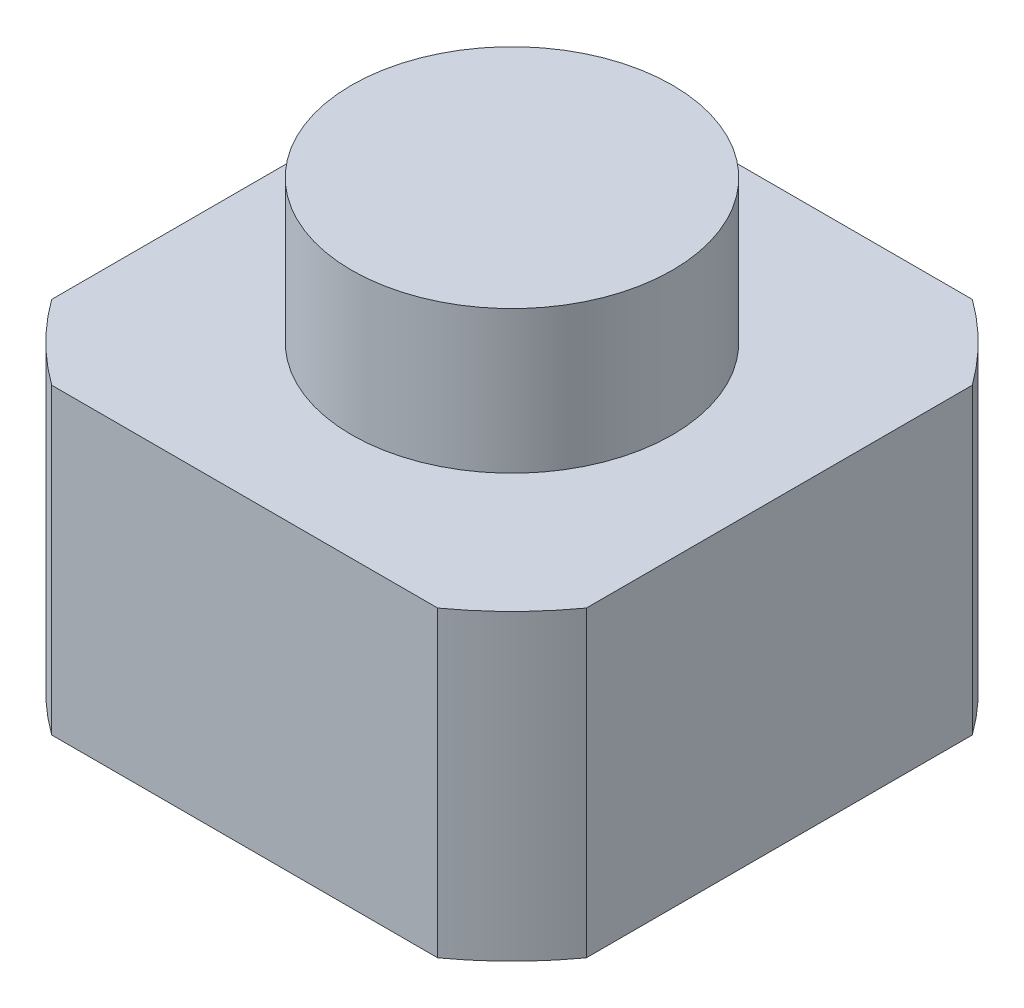
ISO-10303-21;
HEADER;
FILE_DESCRIPTION(('STEP AP214'),'2;1');
FILE_NAME('part.step','',(''),(''),'','','');
FILE_SCHEMA(('AUTOMOTIVE_DESIGN { 1 0 10303 214 1 1 1 1 }'));
ENDSEC;
DATA;
#1=APPLICATION_CONTEXT('core data for automotive mechanical design processes');
#2=APPLICATION_PROTOCOL_DEFINITION('international standard','automotive_design',2000,#1);
#3=PRODUCT_CONTEXT('',#1,'mechanical');
#4=PRODUCT('Part','Part','',(#3));
#5=PRODUCT_RELATED_PRODUCT_CATEGORY('part','',(#4));
#6=PRODUCT_DEFINITION_FORMATION('','',#4);
#7=PRODUCT_DEFINITION_CONTEXT('part definition',#1,'design');
#8=PRODUCT_DEFINITION('design','',#6,#7);
#9=PRODUCT_DEFINITION_SHAPE('','',#8);
#10=(LENGTH_UNIT() NAMED_UNIT(*) SI_UNIT(.MILLI.,.METRE.));
#11=(NAMED_UNIT(*) PLANE_ANGLE_UNIT() SI_UNIT($,.RADIAN.));
#12=(NAMED_UNIT(*) SI_UNIT($,.STERADIAN.) SOLID_ANGLE_UNIT());
#13=UNCERTAINTY_MEASURE_WITH_UNIT(LENGTH_MEASURE(1.E-05),#10,'distance_accuracy_value','');
#14=(GEOMETRIC_REPRESENTATION_CONTEXT(3) GLOBAL_UNCERTAINTY_ASSIGNED_CONTEXT((#13)) GLOBAL_UNIT_ASSIGNED_CONTEXT((#10,
#11,#12)) REPRESENTATION_CONTEXT('',''));
#15=CARTESIAN_POINT('',(0.,0.,0.));
#16=DIRECTION('',(0.,0.,1.));
#17=DIRECTION('',(1.,0.,0.));
#18=AXIS2_PLACEMENT_3D('',#15,#16,#17);
#19=CARTESIAN_POINT('',(0.,3.4,0.));
#20=DIRECTION('',(0.,1.,0.));
#21=DIRECTION('',(0.,0.,1.));
#22=AXIS2_PLACEMENT_3D('',#19,#20,#21);
#23=PLANE('',#22);
#24=CARTESIAN_POINT('',(0.,3.4,0.));
#25=DIRECTION('',(0.,1.,0.));
#26=DIRECTION('',(0.,0.,1.));
#27=AXIS2_PLACEMENT_3D('',#24,#25,#26);
#28=CIRCLE('',#27,3.7);
#29=CARTESIAN_POINT('',(-2.16564078277077,3.4,-3.));
#30=VERTEX_POINT('',#29);
#31=CARTESIAN_POINT('',(-3.,3.4,-2.16564078277077));
#32=VERTEX_POINT('',#31);
#33=EDGE_CURVE('E145',#30,#32,#28,.T.);
#34=ORIENTED_EDGE('',*,*,#33,.T.);
#35=DIRECTION('',(0.,0.,1.));
#36=VECTOR('',#35,1.);
#37=CARTESIAN_POINT('',(-3.,3.4,2.16564078277077));
#38=LINE('',#37,#36);
#39=CARTESIAN_POINT('',(-3.,3.4,2.16564078277077));
#40=VERTEX_POINT('',#39);
#41=EDGE_CURVE('E93',#32,#40,#38,.T.);
#42=ORIENTED_EDGE('',*,*,#41,.T.);
#43=CARTESIAN_POINT('',(0.,3.4,0.));
#44=DIRECTION('',(0.,1.,0.));
#45=DIRECTION('',(0.,0.,1.));
#46=AXIS2_PLACEMENT_3D('',#43,#44,#45);
#47=CIRCLE('',#46,3.7);
#48=CARTESIAN_POINT('',(-2.16564078277077,3.4,3.));
#49=VERTEX_POINT('',#48);
#50=EDGE_CURVE('E160',#40,#49,#47,.T.);
#51=ORIENTED_EDGE('',*,*,#50,.T.);
#52=DIRECTION('',(1.,0.,0.));
#53=VECTOR('',#52,1.);
#54=CARTESIAN_POINT('',(-2.16564078277077,3.4,3.));
#55=LINE('',#54,#53);
#56=CARTESIAN_POINT('',(2.16564078277077,3.4,3.));
#57=VERTEX_POINT('',#56);
#58=EDGE_CURVE('E172',#49,#57,#55,.T.);
#59=ORIENTED_EDGE('',*,*,#58,.T.);
#60=CARTESIAN_POINT('',(0.,3.4,0.));
#61=DIRECTION('',(0.,1.,0.));
#62=DIRECTION('',(0.,0.,1.));
#63=AXIS2_PLACEMENT_3D('',#60,#61,#62);
#64=CIRCLE('',#63,3.7);
#65=CARTESIAN_POINT('',(3.,3.4,2.16564078277077));
#66=VERTEX_POINT('',#65);
#67=EDGE_CURVE('E112',#57,#66,#64,.T.);
#68=ORIENTED_EDGE('',*,*,#67,.T.);
#69=DIRECTION('',(0.,0.,-1.));
#70=VECTOR('',#69,1.);
#71=CARTESIAN_POINT('',(3.,3.4,2.16564078277077));
#72=LINE('',#71,#70);
#73=CARTESIAN_POINT('',(3.,3.4,-2.16564078277077));
#74=VERTEX_POINT('',#73);
#75=EDGE_CURVE('E106',#66,#74,#72,.T.);
#76=ORIENTED_EDGE('',*,*,#75,.T.);
#77=CARTESIAN_POINT('',(0.,3.4,0.));
#78=DIRECTION('',(0.,1.,0.));
#79=DIRECTION('',(0.,0.,1.));
#80=AXIS2_PLACEMENT_3D('',#77,#78,#79);
#81=CIRCLE('',#80,3.7);
#82=CARTESIAN_POINT('',(2.16564078277077,3.4,-3.));
#83=VERTEX_POINT('',#82);
#84=EDGE_CURVE('E110',#74,#83,#81,.T.);
#85=ORIENTED_EDGE('',*,*,#84,.T.);
#86=DIRECTION('',(-1.,0.,0.));
#87=VECTOR('',#86,1.);
#88=CARTESIAN_POINT('',(-2.16564078277077,3.4,-3.));
#89=LINE('',#88,#87);
#90=EDGE_CURVE('E50',#83,#30,#89,.T.);
#91=ORIENTED_EDGE('',*,*,#90,.T.);
#92=EDGE_LOOP('',(#34,#42,#51,#59,#68,#76,#85,#91));
#93=FACE_BOUND('',#92,.T.);
#94=CARTESIAN_POINT('',(0.,3.4,0.));
#95=DIRECTION('',(0.,1.,0.));
#96=DIRECTION('',(0.,0.,1.));
#97=AXIS2_PLACEMENT_3D('',#94,#95,#96);
#98=CIRCLE('',#97,1.8);
#99=CARTESIAN_POINT('',(0.,3.4,1.8));
#100=VERTEX_POINT('',#99);
#101=EDGE_CURVE('E180',#100,#100,#98,.T.);
#102=ORIENTED_EDGE('',*,*,#101,.F.);
#103=EDGE_LOOP('',(#102));
#104=FACE_BOUND('',#103,.T.);
#105=ADVANCED_FACE('F33',(#93,#104),#23,.T.);
#106=CARTESIAN_POINT('',(0.,3.4,0.));
#107=DIRECTION('',(0.,-1.,0.));
#108=DIRECTION('',(0.,0.,-1.));
#109=AXIS2_PLACEMENT_3D('',#106,#107,#108);
#110=CYLINDRICAL_SURFACE('',#109,3.7);
#111=CARTESIAN_POINT('',(0.,0.,0.));
#112=DIRECTION('',(0.,1.,0.));
#113=DIRECTION('',(0.,0.,1.));
#114=AXIS2_PLACEMENT_3D('',#111,#112,#113);
#115=CIRCLE('',#114,3.7);
#116=CARTESIAN_POINT('',(-2.16564078277077,0.,-3.));
#117=VERTEX_POINT('',#116);
#118=CARTESIAN_POINT('',(-3.,0.,-2.16564078277077));
#119=VERTEX_POINT('',#118);
#120=EDGE_CURVE('E130',#117,#119,#115,.T.);
#121=ORIENTED_EDGE('',*,*,#120,.T.);
#122=DIRECTION('',(0.,-1.,0.));
#123=VECTOR('',#122,1.);
#124=CARTESIAN_POINT('',(-3.,3.4,-2.16564078277077));
#125=LINE('',#124,#123);
#126=EDGE_CURVE('E12',#32,#119,#125,.T.);
#127=ORIENTED_EDGE('',*,*,#126,.F.);
#128=ORIENTED_EDGE('',*,*,#33,.F.);
#129=DIRECTION('',(0.,-1.,0.));
#130=VECTOR('',#129,1.);
#131=CARTESIAN_POINT('',(-2.16564078277077,3.4,-3.));
#132=LINE('',#131,#130);
#133=EDGE_CURVE('E126',#30,#117,#132,.T.);
#134=ORIENTED_EDGE('',*,*,#133,.T.);
#135=EDGE_LOOP('',(#121,#127,#128,#134));
#136=FACE_BOUND('',#135,.T.);
#137=ADVANCED_FACE('F35',(#136),#110,.T.);
#138=CARTESIAN_POINT('',(-3.,3.4,2.16564078277077));
#139=DIRECTION('',(1.,0.,0.));
#140=DIRECTION('',(0.,0.,-1.));
#141=AXIS2_PLACEMENT_3D('',#138,#139,#140);
#142=PLANE('',#141);
#143=DIRECTION('',(0.,0.,1.));
#144=VECTOR('',#143,1.);
#145=CARTESIAN_POINT('',(-3.,0.,2.16564078277077));
#146=LINE('',#145,#144);
#147=CARTESIAN_POINT('',(-3.,0.,2.16564078277077));
#148=VERTEX_POINT('',#147);
#149=EDGE_CURVE('E133',#119,#148,#146,.T.);
#150=ORIENTED_EDGE('',*,*,#149,.T.);
#151=DIRECTION('',(0.,-1.,0.));
#152=VECTOR('',#151,1.);
#153=CARTESIAN_POINT('',(-3.,3.4,2.16564078277077));
#154=LINE('',#153,#152);
#155=EDGE_CURVE('E42',#40,#148,#154,.T.);
#156=ORIENTED_EDGE('',*,*,#155,.F.);
#157=ORIENTED_EDGE('',*,*,#41,.F.);
#158=ORIENTED_EDGE('',*,*,#126,.T.);
#159=EDGE_LOOP('',(#150,#156,#157,#158));
#160=FACE_BOUND('',#159,.T.);
#161=ADVANCED_FACE('F191',(#160),#142,.F.);
#162=CARTESIAN_POINT('',(0.,3.4,0.));
#163=DIRECTION('',(0.,-1.,0.));
#164=DIRECTION('',(0.,0.,-1.));
#165=AXIS2_PLACEMENT_3D('',#162,#163,#164);
#166=CYLINDRICAL_SURFACE('',#165,3.7);
#167=CARTESIAN_POINT('',(0.,0.,0.));
#168=DIRECTION('',(0.,1.,0.));
#169=DIRECTION('',(0.,0.,1.));
#170=AXIS2_PLACEMENT_3D('',#167,#168,#169);
#171=CIRCLE('',#170,3.7);
#172=CARTESIAN_POINT('',(-2.16564078277077,0.,3.));
#173=VERTEX_POINT('',#172);
#174=EDGE_CURVE('E136',#148,#173,#171,.T.);
#175=ORIENTED_EDGE('',*,*,#174,.T.);
#176=DIRECTION('',(0.,-1.,0.));
#177=VECTOR('',#176,1.);
#178=CARTESIAN_POINT('',(-2.16564078277077,3.4,3.));
#179=LINE('',#178,#177);
#180=EDGE_CURVE('E152',#49,#173,#179,.T.);
#181=ORIENTED_EDGE('',*,*,#180,.F.);
#182=ORIENTED_EDGE('',*,*,#50,.F.);
#183=ORIENTED_EDGE('',*,*,#155,.T.);
#184=EDGE_LOOP('',(#175,#181,#182,#183));
#185=FACE_BOUND('',#184,.T.);
#186=ADVANCED_FACE('F158',(#185),#166,.T.);
#187=CARTESIAN_POINT('',(-2.16564078277077,3.4,3.));
#188=DIRECTION('',(0.,0.,-1.));
#189=DIRECTION('',(-1.,0.,0.));
#190=AXIS2_PLACEMENT_3D('',#187,#188,#189);
#191=PLANE('',#190);
#192=DIRECTION('',(1.,0.,0.));
#193=VECTOR('',#192,1.);
#194=CARTESIAN_POINT('',(-2.16564078277077,0.,3.));
#195=LINE('',#194,#193);
#196=CARTESIAN_POINT('',(2.16564078277077,0.,3.));
#197=VERTEX_POINT('',#196);
#198=EDGE_CURVE('E138',#173,#197,#195,.T.);
#199=ORIENTED_EDGE('',*,*,#198,.T.);
#200=DIRECTION('',(0.,-1.,0.));
#201=VECTOR('',#200,1.);
#202=CARTESIAN_POINT('',(2.16564078277077,3.4,3.));
#203=LINE('',#202,#201);
#204=EDGE_CURVE('E149',#57,#197,#203,.T.);
#205=ORIENTED_EDGE('',*,*,#204,.F.);
#206=ORIENTED_EDGE('',*,*,#58,.F.);
#207=ORIENTED_EDGE('',*,*,#180,.T.);
#208=EDGE_LOOP('',(#199,#205,#206,#207));
#209=FACE_BOUND('',#208,.T.);
#210=ADVANCED_FACE('F168',(#209),#191,.F.);
#211=CARTESIAN_POINT('',(0.,3.4,0.));
#212=DIRECTION('',(0.,-1.,0.));
#213=DIRECTION('',(0.,0.,-1.));
#214=AXIS2_PLACEMENT_3D('',#211,#212,#213);
#215=CYLINDRICAL_SURFACE('',#214,3.7);
#216=CARTESIAN_POINT('',(0.,0.,0.));
#217=DIRECTION('',(0.,1.,0.));
#218=DIRECTION('',(0.,0.,1.));
#219=AXIS2_PLACEMENT_3D('',#216,#217,#218);
#220=CIRCLE('',#219,3.7);
#221=CARTESIAN_POINT('',(3.,0.,2.16564078277077));
#222=VERTEX_POINT('',#221);
#223=EDGE_CURVE('E140',#197,#222,#220,.T.);
#224=ORIENTED_EDGE('',*,*,#223,.T.);
#225=DIRECTION('',(0.,-1.,0.));
#226=VECTOR('',#225,1.);
#227=CARTESIAN_POINT('',(3.,3.4,2.16564078277077));
#228=LINE('',#227,#226);
#229=EDGE_CURVE('E121',#66,#222,#228,.T.);
#230=ORIENTED_EDGE('',*,*,#229,.F.);
#231=ORIENTED_EDGE('',*,*,#67,.F.);
#232=ORIENTED_EDGE('',*,*,#204,.T.);
#233=EDGE_LOOP('',(#224,#230,#231,#232));
#234=FACE_BOUND('',#233,.T.);
#235=ADVANCED_FACE('F171',(#234),#215,.T.);
#236=CARTESIAN_POINT('',(3.,3.4,2.16564078277077));
#237=DIRECTION('',(-1.,0.,0.));
#238=DIRECTION('',(0.,0.,1.));
#239=AXIS2_PLACEMENT_3D('',#236,#237,#238);
#240=PLANE('',#239);
#241=DIRECTION('',(0.,0.,-1.));
#242=VECTOR('',#241,1.);
#243=CARTESIAN_POINT('',(3.,0.,2.16564078277077));
#244=LINE('',#243,#242);
#245=CARTESIAN_POINT('',(3.,0.,-2.16564078277077));
#246=VERTEX_POINT('',#245);
#247=EDGE_CURVE('E120',#222,#246,#244,.T.);
#248=ORIENTED_EDGE('',*,*,#247,.T.);
#249=DIRECTION('',(0.,-1.,0.));
#250=VECTOR('',#249,1.);
#251=CARTESIAN_POINT('',(3.,3.4,-2.16564078277077));
#252=LINE('',#251,#250);
#253=EDGE_CURVE('E117',#74,#246,#252,.T.);
#254=ORIENTED_EDGE('',*,*,#253,.F.);
#255=ORIENTED_EDGE('',*,*,#75,.F.);
#256=ORIENTED_EDGE('',*,*,#229,.T.);
#257=EDGE_LOOP('',(#248,#254,#255,#256));
#258=FACE_BOUND('',#257,.T.);
#259=ADVANCED_FACE('F118',(#258),#240,.F.);
#260=CARTESIAN_POINT('',(0.,3.4,0.));
#261=DIRECTION('',(0.,-1.,0.));
#262=DIRECTION('',(0.,0.,-1.));
#263=AXIS2_PLACEMENT_3D('',#260,#261,#262);
#264=CYLINDRICAL_SURFACE('',#263,3.7);
#265=CARTESIAN_POINT('',(0.,0.,0.));
#266=DIRECTION('',(0.,1.,0.));
#267=DIRECTION('',(0.,0.,1.));
#268=AXIS2_PLACEMENT_3D('',#265,#266,#267);
#269=CIRCLE('',#268,3.7);
#270=CARTESIAN_POINT('',(2.16564078277077,0.,-3.));
#271=VERTEX_POINT('',#270);
#272=EDGE_CURVE('E79',#246,#271,#269,.T.);
#273=ORIENTED_EDGE('',*,*,#272,.T.);
#274=DIRECTION('',(0.,-1.,0.));
#275=VECTOR('',#274,1.);
#276=CARTESIAN_POINT('',(2.16564078277077,3.4,-3.));
#277=LINE('',#276,#275);
#278=EDGE_CURVE('E122',#83,#271,#277,.T.);
#279=ORIENTED_EDGE('',*,*,#278,.F.);
#280=ORIENTED_EDGE('',*,*,#84,.F.);
#281=ORIENTED_EDGE('',*,*,#253,.T.);
#282=EDGE_LOOP('',(#273,#279,#280,#281));
#283=FACE_BOUND('',#282,.T.);
#284=ADVANCED_FACE('F124',(#283),#264,.T.);
#285=CARTESIAN_POINT('',(-2.16564078277077,3.4,-3.));
#286=DIRECTION('',(0.,0.,1.));
#287=DIRECTION('',(1.,0.,0.));
#288=AXIS2_PLACEMENT_3D('',#285,#286,#287);
#289=PLANE('',#288);
#290=DIRECTION('',(-1.,0.,0.));
#291=VECTOR('',#290,1.);
#292=CARTESIAN_POINT('',(-2.16564078277077,0.,-3.));
#293=LINE('',#292,#291);
#294=EDGE_CURVE('E85',#271,#117,#293,.T.);
#295=ORIENTED_EDGE('',*,*,#294,.T.);
#296=ORIENTED_EDGE('',*,*,#133,.F.);
#297=ORIENTED_EDGE('',*,*,#90,.F.);
#298=ORIENTED_EDGE('',*,*,#278,.T.);
#299=EDGE_LOOP('',(#295,#296,#297,#298));
#300=FACE_BOUND('',#299,.T.);
#301=ADVANCED_FACE('F199',(#300),#289,.F.);
#302=CARTESIAN_POINT('',(0.,0.,0.));
#303=DIRECTION('',(0.,1.,0.));
#304=DIRECTION('',(0.,0.,1.));
#305=AXIS2_PLACEMENT_3D('',#302,#303,#304);
#306=PLANE('',#305);
#307=ORIENTED_EDGE('',*,*,#120,.F.);
#308=ORIENTED_EDGE('',*,*,#294,.F.);
#309=ORIENTED_EDGE('',*,*,#272,.F.);
#310=ORIENTED_EDGE('',*,*,#247,.F.);
#311=ORIENTED_EDGE('',*,*,#223,.F.);
#312=ORIENTED_EDGE('',*,*,#198,.F.);
#313=ORIENTED_EDGE('',*,*,#174,.F.);
#314=ORIENTED_EDGE('',*,*,#149,.F.);
#315=EDGE_LOOP('',(#307,#308,#309,#310,#311,#312,#313,#314));
#316=FACE_BOUND('',#315,.T.);
#317=ADVANCED_FACE('F164',(#316),#306,.F.);
#318=CARTESIAN_POINT('',(0.,15.0911688245431,0.));
#319=DIRECTION('',(0.,-1.,0.));
#320=DIRECTION('',(0.,0.,-1.));
#321=AXIS2_PLACEMENT_3D('',#318,#319,#320);
#322=CYLINDRICAL_SURFACE('',#321,1.8);
#323=ORIENTED_EDGE('',*,*,#101,.T.);
#324=EDGE_LOOP('',(#323));
#325=FACE_BOUND('',#324,.T.);
#326=CARTESIAN_POINT('',(0.,5.,0.));
#327=DIRECTION('',(0.,1.,0.));
#328=DIRECTION('',(0.,0.,1.));
#329=AXIS2_PLACEMENT_3D('',#326,#327,#328);
#330=CIRCLE('',#329,1.8);
#331=CARTESIAN_POINT('',(0.,5.,1.8));
#332=VERTEX_POINT('',#331);
#333=EDGE_CURVE('E134',#332,#332,#330,.T.);
#334=ORIENTED_EDGE('',*,*,#333,.F.);
#335=EDGE_LOOP('',(#334));
#336=FACE_BOUND('',#335,.T.);
#337=ADVANCED_FACE('F184',(#325,#336),#322,.T.);
#338=CARTESIAN_POINT('',(0.,5.,0.));
#339=DIRECTION('',(0.,1.,0.));
#340=DIRECTION('',(0.,0.,1.));
#341=AXIS2_PLACEMENT_3D('',#338,#339,#340);
#342=PLANE('',#341);
#343=ORIENTED_EDGE('',*,*,#333,.T.);
#344=EDGE_LOOP('',(#343));
#345=FACE_BOUND('',#344,.T.);
#346=ADVANCED_FACE('F195',(#345),#342,.T.);
#347=CLOSED_SHELL('',(#105,#137,#161,#186,#210,#235,#259,#284,#301,#317,#337,#346));
#348=MANIFOLD_SOLID_BREP('B2',#347);
#349=ADVANCED_BREP_SHAPE_REPRESENTATION('',(#18,#348),#14);
#350=SHAPE_DEFINITION_REPRESENTATION(#9,#349);
ENDSEC;
END-ISO-10303-21;
